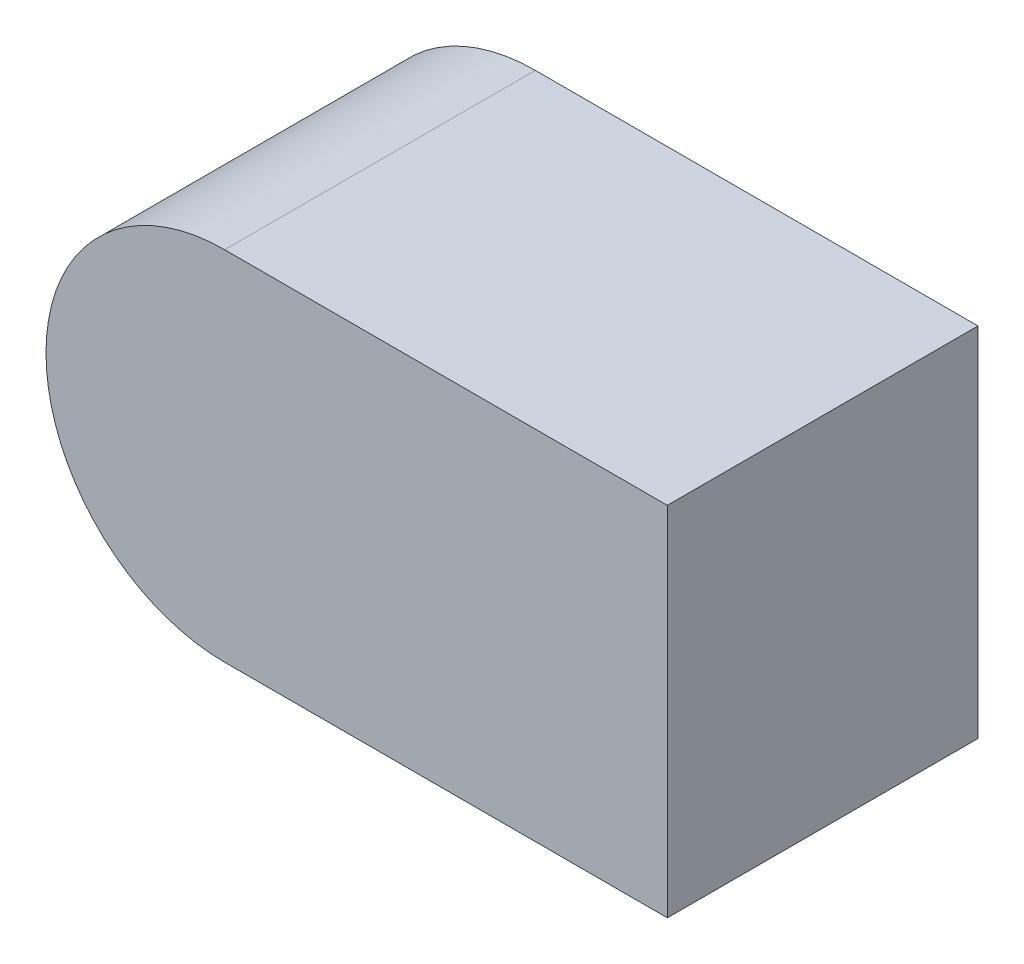
ISO-10303-21;
HEADER;
FILE_DESCRIPTION(('STEP AP214'),'2;1');
FILE_NAME('part.step','',(''),(''),'','','');
FILE_SCHEMA(('AUTOMOTIVE_DESIGN { 1 0 10303 214 1 1 1 1 }'));
ENDSEC;
DATA;
#1=APPLICATION_CONTEXT('core data for automotive mechanical design processes');
#2=APPLICATION_PROTOCOL_DEFINITION('international standard','automotive_design',2000,#1);
#3=PRODUCT_CONTEXT('',#1,'mechanical');
#4=PRODUCT('Part','Part','',(#3));
#5=PRODUCT_RELATED_PRODUCT_CATEGORY('part','',(#4));
#6=PRODUCT_DEFINITION_FORMATION('','',#4);
#7=PRODUCT_DEFINITION_CONTEXT('part definition',#1,'design');
#8=PRODUCT_DEFINITION('design','',#6,#7);
#9=PRODUCT_DEFINITION_SHAPE('','',#8);
#10=(LENGTH_UNIT() NAMED_UNIT(*) SI_UNIT(.MILLI.,.METRE.));
#11=(NAMED_UNIT(*) PLANE_ANGLE_UNIT() SI_UNIT($,.RADIAN.));
#12=(NAMED_UNIT(*) SI_UNIT($,.STERADIAN.) SOLID_ANGLE_UNIT());
#13=UNCERTAINTY_MEASURE_WITH_UNIT(LENGTH_MEASURE(1.E-05),#10,'distance_accuracy_value','');
#14=(GEOMETRIC_REPRESENTATION_CONTEXT(3) GLOBAL_UNCERTAINTY_ASSIGNED_CONTEXT((#13)) GLOBAL_UNIT_ASSIGNED_CONTEXT((#10,
#11,#12)) REPRESENTATION_CONTEXT('',''));
#15=CARTESIAN_POINT('',(0.,0.,0.));
#16=DIRECTION('',(0.,0.,1.));
#17=DIRECTION('',(1.,0.,0.));
#18=AXIS2_PLACEMENT_3D('',#15,#16,#17);
#19=CARTESIAN_POINT('',(2.8335240809167,-1.25,0.2));
#20=DIRECTION('',(0.,0.,1.));
#21=DIRECTION('',(1.,0.,0.));
#22=AXIS2_PLACEMENT_3D('',#19,#20,#21);
#23=PLANE('',#22);
#24=DIRECTION('',(1.,0.,0.));
#25=VECTOR('',#24,1.);
#26=CARTESIAN_POINT('',(2.715,-1.365,0.2));
#27=LINE('',#26,#25);
#28=CARTESIAN_POINT('',(2.715,-1.365,0.2));
#29=VERTEX_POINT('',#28);
#30=CARTESIAN_POINT('',(3.,-1.365,0.2));
#31=VERTEX_POINT('',#30);
#32=EDGE_CURVE('E11',#29,#31,#27,.T.);
#33=ORIENTED_EDGE('',*,*,#32,.T.);
#34=DIRECTION('',(0.,1.,0.));
#35=VECTOR('',#34,1.);
#36=CARTESIAN_POINT('',(3.,-2.125,0.2));
#37=LINE('',#36,#35);
#38=CARTESIAN_POINT('',(3.,-1.135,0.2));
#39=VERTEX_POINT('',#38);
#40=EDGE_CURVE('E24',#31,#39,#37,.T.);
#41=ORIENTED_EDGE('',*,*,#40,.T.);
#42=DIRECTION('',(-1.,0.,0.));
#43=VECTOR('',#42,1.);
#44=CARTESIAN_POINT('',(3.,-1.135,0.2));
#45=LINE('',#44,#43);
#46=CARTESIAN_POINT('',(2.715,-1.135,0.2));
#47=VERTEX_POINT('',#46);
#48=EDGE_CURVE('E88',#39,#47,#45,.T.);
#49=ORIENTED_EDGE('',*,*,#48,.T.);
#50=CARTESIAN_POINT('',(2.715,-1.25,0.2));
#51=DIRECTION('',(0.,0.,1.));
#52=DIRECTION('',(0.,1.,0.));
#53=AXIS2_PLACEMENT_3D('',#50,#51,#52);
#54=CIRCLE('',#53,0.115);
#55=EDGE_CURVE('E70',#47,#29,#54,.T.);
#56=ORIENTED_EDGE('',*,*,#55,.T.);
#57=EDGE_LOOP('',(#33,#41,#49,#56));
#58=FACE_BOUND('',#57,.T.);
#59=ADVANCED_FACE('F17',(#58),#23,.T.);
#60=CARTESIAN_POINT('',(3.,-3.,0.));
#61=DIRECTION('',(1.,0.,0.));
#62=DIRECTION('',(0.,1.,0.));
#63=AXIS2_PLACEMENT_3D('',#60,#61,#62);
#64=PLANE('',#63);
#65=DIRECTION('',(0.,0.,-1.));
#66=VECTOR('',#65,1.);
#67=CARTESIAN_POINT('',(3.,-1.135,0.));
#68=LINE('',#67,#66);
#69=CARTESIAN_POINT('',(3.,-1.135,0.));
#70=VERTEX_POINT('',#69);
#71=EDGE_CURVE('E76',#39,#70,#68,.T.);
#72=ORIENTED_EDGE('',*,*,#71,.F.);
#73=ORIENTED_EDGE('',*,*,#40,.F.);
#74=DIRECTION('',(0.,0.,1.));
#75=VECTOR('',#74,1.);
#76=CARTESIAN_POINT('',(3.,-1.365,0.));
#77=LINE('',#76,#75);
#78=CARTESIAN_POINT('',(3.,-1.365,0.));
#79=VERTEX_POINT('',#78);
#80=EDGE_CURVE('E84',#79,#31,#77,.T.);
#81=ORIENTED_EDGE('',*,*,#80,.F.);
#82=DIRECTION('',(0.,1.,0.));
#83=VECTOR('',#82,1.);
#84=CARTESIAN_POINT('',(3.,-1.365,0.));
#85=LINE('',#84,#83);
#86=EDGE_CURVE('E82',#79,#70,#85,.T.);
#87=ORIENTED_EDGE('',*,*,#86,.T.);
#88=EDGE_LOOP('',(#72,#73,#81,#87));
#89=FACE_BOUND('',#88,.T.);
#90=ADVANCED_FACE('F90',(#89),#64,.T.);
#91=CARTESIAN_POINT('',(2.715,-1.365,0.));
#92=DIRECTION('',(0.,-1.,0.));
#93=DIRECTION('',(1.,0.,0.));
#94=AXIS2_PLACEMENT_3D('',#91,#92,#93);
#95=PLANE('',#94);
#96=DIRECTION('',(1.,0.,0.));
#97=VECTOR('',#96,1.);
#98=CARTESIAN_POINT('',(2.715,-1.365,0.));
#99=LINE('',#98,#97);
#100=CARTESIAN_POINT('',(2.715,-1.365,0.));
#101=VERTEX_POINT('',#100);
#102=EDGE_CURVE('E61',#101,#79,#99,.T.);
#103=ORIENTED_EDGE('',*,*,#102,.T.);
#104=ORIENTED_EDGE('',*,*,#80,.T.);
#105=ORIENTED_EDGE('',*,*,#32,.F.);
#106=DIRECTION('',(0.,0.,1.));
#107=VECTOR('',#106,1.);
#108=CARTESIAN_POINT('',(2.715,-1.365,0.));
#109=LINE('',#108,#107);
#110=EDGE_CURVE('E64',#101,#29,#109,.T.);
#111=ORIENTED_EDGE('',*,*,#110,.F.);
#112=EDGE_LOOP('',(#103,#104,#105,#111));
#113=FACE_BOUND('',#112,.T.);
#114=ADVANCED_FACE('F91',(#113),#95,.T.);
#115=CARTESIAN_POINT('',(2.715,-1.25,0.));
#116=DIRECTION('',(0.,0.,1.));
#117=DIRECTION('',(0.,1.,0.));
#118=AXIS2_PLACEMENT_3D('',#115,#116,#117);
#119=CYLINDRICAL_SURFACE('',#118,0.115);
#120=CARTESIAN_POINT('',(2.715,-1.25,0.));
#121=DIRECTION('',(0.,0.,1.));
#122=DIRECTION('',(0.,1.,0.));
#123=AXIS2_PLACEMENT_3D('',#120,#121,#122);
#124=CIRCLE('',#123,0.115);
#125=CARTESIAN_POINT('',(2.715,-1.135,0.));
#126=VERTEX_POINT('',#125);
#127=EDGE_CURVE('E54',#126,#101,#124,.T.);
#128=ORIENTED_EDGE('',*,*,#127,.T.);
#129=ORIENTED_EDGE('',*,*,#110,.T.);
#130=ORIENTED_EDGE('',*,*,#55,.F.);
#131=DIRECTION('',(0.,0.,1.));
#132=VECTOR('',#131,1.);
#133=CARTESIAN_POINT('',(2.715,-1.135,0.));
#134=LINE('',#133,#132);
#135=EDGE_CURVE('E65',#126,#47,#134,.T.);
#136=ORIENTED_EDGE('',*,*,#135,.F.);
#137=EDGE_LOOP('',(#128,#129,#130,#136));
#138=FACE_BOUND('',#137,.T.);
#139=ADVANCED_FACE('F69',(#138),#119,.T.);
#140=CARTESIAN_POINT('',(3.,-1.135,0.));
#141=DIRECTION('',(0.,1.,0.));
#142=DIRECTION('',(-1.,0.,0.));
#143=AXIS2_PLACEMENT_3D('',#140,#141,#142);
#144=PLANE('',#143);
#145=DIRECTION('',(-1.,0.,0.));
#146=VECTOR('',#145,1.);
#147=CARTESIAN_POINT('',(3.,-1.135,0.));
#148=LINE('',#147,#146);
#149=EDGE_CURVE('E59',#70,#126,#148,.T.);
#150=ORIENTED_EDGE('',*,*,#149,.T.);
#151=ORIENTED_EDGE('',*,*,#135,.T.);
#152=ORIENTED_EDGE('',*,*,#48,.F.);
#153=ORIENTED_EDGE('',*,*,#71,.T.);
#154=EDGE_LOOP('',(#150,#151,#152,#153));
#155=FACE_BOUND('',#154,.T.);
#156=ADVANCED_FACE('F74',(#155),#144,.T.);
#157=CARTESIAN_POINT('',(2.8335265642716,-1.25,0.));
#158=DIRECTION('',(0.,0.,1.));
#159=DIRECTION('',(-1.,0.,0.));
#160=AXIS2_PLACEMENT_3D('',#157,#158,#159);
#161=PLANE('',#160);
#162=ORIENTED_EDGE('',*,*,#86,.F.);
#163=ORIENTED_EDGE('',*,*,#102,.F.);
#164=ORIENTED_EDGE('',*,*,#127,.F.);
#165=ORIENTED_EDGE('',*,*,#149,.F.);
#166=EDGE_LOOP('',(#162,#163,#164,#165));
#167=FACE_BOUND('',#166,.T.);
#168=ADVANCED_FACE('F57',(#167),#161,.F.);
#169=CLOSED_SHELL('',(#59,#90,#114,#139,#156,#168));
#170=MANIFOLD_SOLID_BREP('B1',#169);
#171=ADVANCED_BREP_SHAPE_REPRESENTATION('',(#18,#170),#14);
#172=SHAPE_DEFINITION_REPRESENTATION(#9,#171);
ENDSEC;
END-ISO-10303-21;
